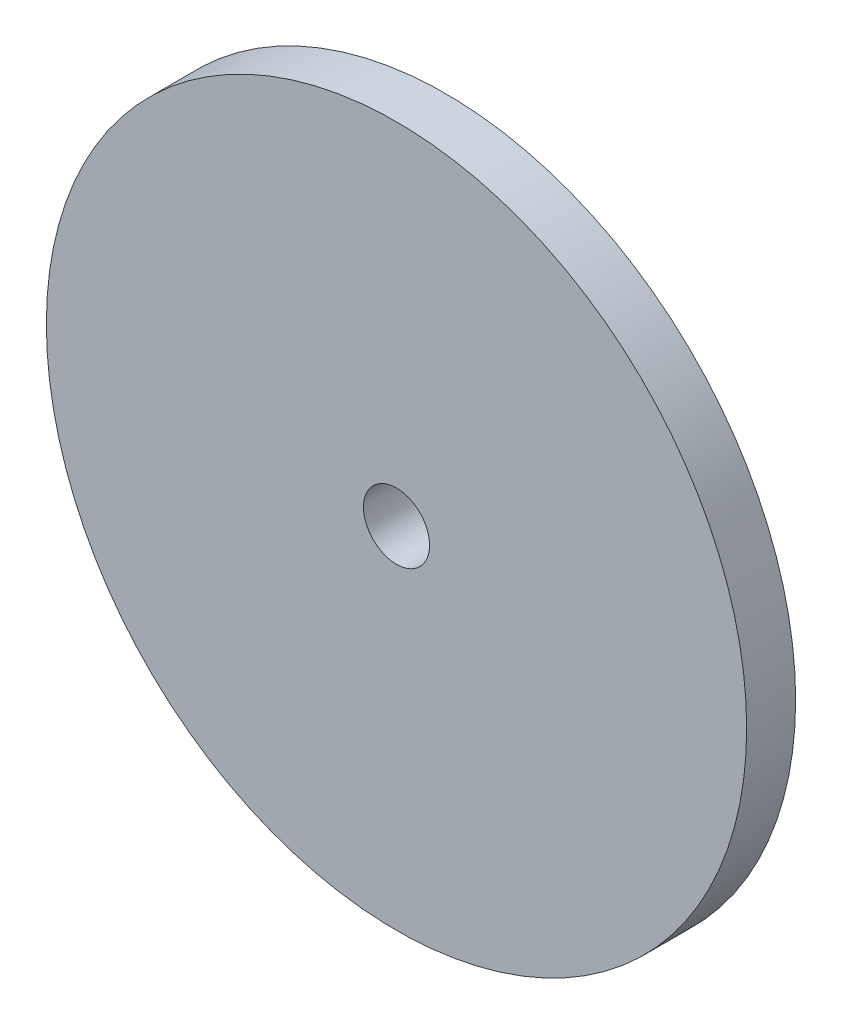
ISO-10303-21;
HEADER;
FILE_DESCRIPTION(('STEP AP214'),'2;1');
FILE_NAME('part.step','',(''),(''),'','','');
FILE_SCHEMA(('AUTOMOTIVE_DESIGN { 1 0 10303 214 1 1 1 1 }'));
ENDSEC;
DATA;
#1=APPLICATION_CONTEXT('core data for automotive mechanical design processes');
#2=APPLICATION_PROTOCOL_DEFINITION('international standard','automotive_design',2000,#1);
#3=PRODUCT_CONTEXT('',#1,'mechanical');
#4=PRODUCT('Part','Part','',(#3));
#5=PRODUCT_RELATED_PRODUCT_CATEGORY('part','',(#4));
#6=PRODUCT_DEFINITION_FORMATION('','',#4);
#7=PRODUCT_DEFINITION_CONTEXT('part definition',#1,'design');
#8=PRODUCT_DEFINITION('design','',#6,#7);
#9=PRODUCT_DEFINITION_SHAPE('','',#8);
#10=(LENGTH_UNIT() NAMED_UNIT(*) SI_UNIT(.MILLI.,.METRE.));
#11=(NAMED_UNIT(*) PLANE_ANGLE_UNIT() SI_UNIT($,.RADIAN.));
#12=(NAMED_UNIT(*) SI_UNIT($,.STERADIAN.) SOLID_ANGLE_UNIT());
#13=UNCERTAINTY_MEASURE_WITH_UNIT(LENGTH_MEASURE(1.E-05),#10,'distance_accuracy_value','');
#14=(GEOMETRIC_REPRESENTATION_CONTEXT(3) GLOBAL_UNCERTAINTY_ASSIGNED_CONTEXT((#13)) GLOBAL_UNIT_ASSIGNED_CONTEXT((#10,
#11,#12)) REPRESENTATION_CONTEXT('',''));
#15=CARTESIAN_POINT('',(0.,0.,0.));
#16=DIRECTION('',(0.,0.,1.));
#17=DIRECTION('',(1.,0.,0.));
#18=AXIS2_PLACEMENT_3D('',#15,#16,#17);
#19=CARTESIAN_POINT('',(0.,0.,2.));
#20=DIRECTION('',(0.,0.,1.));
#21=DIRECTION('',(1.,0.,0.));
#22=AXIS2_PLACEMENT_3D('',#19,#20,#21);
#23=PLANE('',#22);
#24=CARTESIAN_POINT('',(0.,0.,2.));
#25=DIRECTION('',(0.,0.,1.));
#26=DIRECTION('',(1.,0.,0.));
#27=AXIS2_PLACEMENT_3D('',#24,#25,#26);
#28=CIRCLE('',#27,14.3);
#29=CARTESIAN_POINT('',(14.3,0.,2.));
#30=VERTEX_POINT('',#29);
#31=EDGE_CURVE('E10',#30,#30,#28,.T.);
#32=ORIENTED_EDGE('',*,*,#31,.T.);
#33=EDGE_LOOP('',(#32));
#34=FACE_BOUND('',#33,.T.);
#35=CARTESIAN_POINT('',(0.,0.,2.));
#36=DIRECTION('',(0.,0.,1.));
#37=DIRECTION('',(1.,0.,0.));
#38=AXIS2_PLACEMENT_3D('',#35,#36,#37);
#39=CIRCLE('',#38,1.35);
#40=CARTESIAN_POINT('',(1.35,0.,2.));
#41=VERTEX_POINT('',#40);
#42=EDGE_CURVE('E42',#41,#41,#39,.T.);
#43=ORIENTED_EDGE('',*,*,#42,.F.);
#44=EDGE_LOOP('',(#43));
#45=FACE_BOUND('',#44,.T.);
#46=ADVANCED_FACE('F31',(#34,#45),#23,.T.);
#47=CARTESIAN_POINT('',(0.,0.,0.));
#48=DIRECTION('',(0.,0.,1.));
#49=DIRECTION('',(1.,0.,0.));
#50=AXIS2_PLACEMENT_3D('',#47,#48,#49);
#51=PLANE('',#50);
#52=CARTESIAN_POINT('',(0.,0.,0.));
#53=DIRECTION('',(0.,0.,1.));
#54=DIRECTION('',(1.,0.,0.));
#55=AXIS2_PLACEMENT_3D('',#52,#53,#54);
#56=CIRCLE('',#55,14.3);
#57=CARTESIAN_POINT('',(14.3,0.,0.));
#58=VERTEX_POINT('',#57);
#59=EDGE_CURVE('E35',#58,#58,#56,.T.);
#60=ORIENTED_EDGE('',*,*,#59,.F.);
#61=EDGE_LOOP('',(#60));
#62=FACE_BOUND('',#61,.T.);
#63=CARTESIAN_POINT('',(0.,0.,0.));
#64=DIRECTION('',(0.,0.,1.));
#65=DIRECTION('',(1.,0.,0.));
#66=AXIS2_PLACEMENT_3D('',#63,#64,#65);
#67=CIRCLE('',#66,1.35);
#68=CARTESIAN_POINT('',(1.35,0.,0.));
#69=VERTEX_POINT('',#68);
#70=EDGE_CURVE('E44',#69,#69,#67,.T.);
#71=ORIENTED_EDGE('',*,*,#70,.T.);
#72=EDGE_LOOP('',(#71));
#73=FACE_BOUND('',#72,.T.);
#74=ADVANCED_FACE('F54',(#62,#73),#51,.F.);
#75=CARTESIAN_POINT('',(0.,0.,2.));
#76=DIRECTION('',(0.,0.,-1.));
#77=DIRECTION('',(-1.,0.,0.));
#78=AXIS2_PLACEMENT_3D('',#75,#76,#77);
#79=CYLINDRICAL_SURFACE('',#78,14.3);
#80=ORIENTED_EDGE('',*,*,#31,.F.);
#81=EDGE_LOOP('',(#80));
#82=FACE_BOUND('',#81,.T.);
#83=ORIENTED_EDGE('',*,*,#59,.T.);
#84=EDGE_LOOP('',(#83));
#85=FACE_BOUND('',#84,.T.);
#86=ADVANCED_FACE('F33',(#82,#85),#79,.T.);
#87=CARTESIAN_POINT('',(0.,0.,2.));
#88=DIRECTION('',(0.,0.,-1.));
#89=DIRECTION('',(-1.,0.,0.));
#90=AXIS2_PLACEMENT_3D('',#87,#88,#89);
#91=CYLINDRICAL_SURFACE('',#90,1.35);
#92=ORIENTED_EDGE('',*,*,#42,.T.);
#93=EDGE_LOOP('',(#92));
#94=FACE_BOUND('',#93,.T.);
#95=ORIENTED_EDGE('',*,*,#70,.F.);
#96=EDGE_LOOP('',(#95));
#97=FACE_BOUND('',#96,.T.);
#98=ADVANCED_FACE('F50',(#94,#97),#91,.F.);
#99=CLOSED_SHELL('',(#46,#74,#86,#98));
#100=MANIFOLD_SOLID_BREP('B2',#99);
#101=ADVANCED_BREP_SHAPE_REPRESENTATION('',(#18,#100),#14);
#102=SHAPE_DEFINITION_REPRESENTATION(#9,#101);
ENDSEC;
END-ISO-10303-21;
